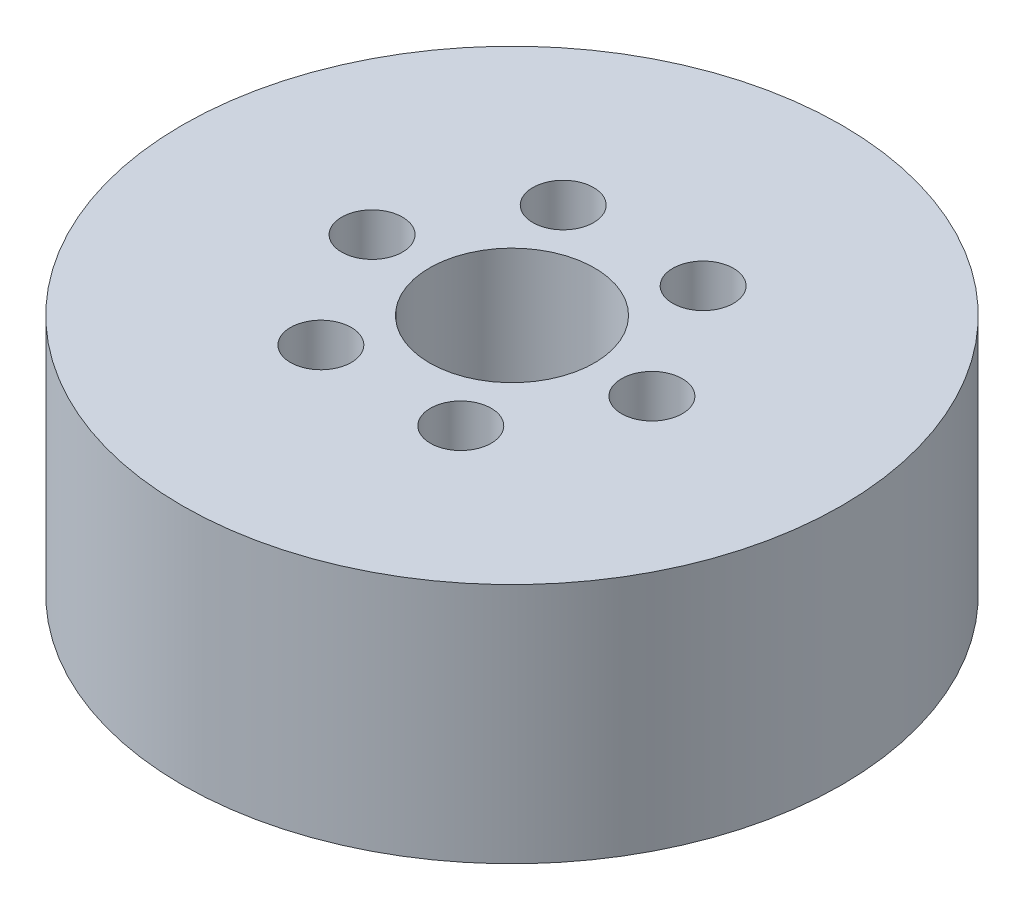
ISO-10303-21;
HEADER;
FILE_DESCRIPTION(('STEP AP214'),'2;1');
FILE_NAME('part.step','',(''),(''),'','','');
FILE_SCHEMA(('AUTOMOTIVE_DESIGN { 1 0 10303 214 1 1 1 1 }'));
ENDSEC;
DATA;
#1=APPLICATION_CONTEXT('core data for automotive mechanical design processes');
#2=APPLICATION_PROTOCOL_DEFINITION('international standard','automotive_design',2000,#1);
#3=PRODUCT_CONTEXT('',#1,'mechanical');
#4=PRODUCT('Part','Part','',(#3));
#5=PRODUCT_RELATED_PRODUCT_CATEGORY('part','',(#4));
#6=PRODUCT_DEFINITION_FORMATION('','',#4);
#7=PRODUCT_DEFINITION_CONTEXT('part definition',#1,'design');
#8=PRODUCT_DEFINITION('design','',#6,#7);
#9=PRODUCT_DEFINITION_SHAPE('','',#8);
#10=(LENGTH_UNIT() NAMED_UNIT(*) SI_UNIT(.MILLI.,.METRE.));
#11=(NAMED_UNIT(*) PLANE_ANGLE_UNIT() SI_UNIT($,.RADIAN.));
#12=(NAMED_UNIT(*) SI_UNIT($,.STERADIAN.) SOLID_ANGLE_UNIT());
#13=UNCERTAINTY_MEASURE_WITH_UNIT(LENGTH_MEASURE(1.E-05),#10,'distance_accuracy_value','');
#14=(GEOMETRIC_REPRESENTATION_CONTEXT(3) GLOBAL_UNCERTAINTY_ASSIGNED_CONTEXT((#13)) GLOBAL_UNIT_ASSIGNED_CONTEXT((#10,
#11,#12)) REPRESENTATION_CONTEXT('',''));
#15=CARTESIAN_POINT('',(0.,0.,0.));
#16=DIRECTION('',(0.,0.,1.));
#17=DIRECTION('',(1.,0.,0.));
#18=AXIS2_PLACEMENT_3D('',#15,#16,#17);
#19=CARTESIAN_POINT('',(0.,22.,0.));
#20=DIRECTION('',(0.,-1.,0.));
#21=DIRECTION('',(0.,0.,-1.));
#22=AXIS2_PLACEMENT_3D('',#19,#20,#21);
#23=CYLINDRICAL_SURFACE('',#22,30.);
#24=CARTESIAN_POINT('',(0.,22.,0.));
#25=DIRECTION('',(0.,1.,0.));
#26=DIRECTION('',(0.,0.,1.));
#27=AXIS2_PLACEMENT_3D('',#24,#25,#26);
#28=CIRCLE('',#27,30.);
#29=CARTESIAN_POINT('',(0.,22.,30.));
#30=VERTEX_POINT('',#29);
#31=EDGE_CURVE('E10',#30,#30,#28,.T.);
#32=ORIENTED_EDGE('',*,*,#31,.F.);
#33=EDGE_LOOP('',(#32));
#34=FACE_BOUND('',#33,.T.);
#35=CARTESIAN_POINT('',(0.,0.,0.));
#36=DIRECTION('',(0.,1.,0.));
#37=DIRECTION('',(0.,0.,1.));
#38=AXIS2_PLACEMENT_3D('',#35,#36,#37);
#39=CIRCLE('',#38,30.);
#40=CARTESIAN_POINT('',(0.,0.,30.));
#41=VERTEX_POINT('',#40);
#42=EDGE_CURVE('E37',#41,#41,#39,.T.);
#43=ORIENTED_EDGE('',*,*,#42,.T.);
#44=EDGE_LOOP('',(#43));
#45=FACE_BOUND('',#44,.T.);
#46=ADVANCED_FACE('F40',(#34,#45),#23,.T.);
#47=CARTESIAN_POINT('',(0.,22.,0.));
#48=DIRECTION('',(0.,1.,0.));
#49=DIRECTION('',(0.,0.,1.));
#50=AXIS2_PLACEMENT_3D('',#47,#48,#49);
#51=PLANE('',#50);
#52=CARTESIAN_POINT('',(-6.36563340943229,22.,-11.0256004874943));
#53=DIRECTION('',(0.,1.,0.));
#54=DIRECTION('',(-0.866025403784433,0.,0.50000000000001));
#55=AXIS2_PLACEMENT_3D('',#52,#53,#54);
#56=CIRCLE('',#55,2.76569619181548);
#57=CARTESIAN_POINT('',(-8.76079657069436,22.,-9.64275239158656));
#58=VERTEX_POINT('',#57);
#59=EDGE_CURVE('E70',#58,#58,#56,.T.);
#60=ORIENTED_EDGE('',*,*,#59,.F.);
#61=EDGE_LOOP('',(#60));
#62=FACE_BOUND('',#61,.T.);
#63=CARTESIAN_POINT('',(6.36563340943206,22.,-11.0256004874945));
#64=DIRECTION('',(0.,1.,0.));
#65=DIRECTION('',(-0.866025403784443,0.,-0.499999999999992));
#66=AXIS2_PLACEMENT_3D('',#63,#64,#65);
#67=CIRCLE('',#66,2.76569619181548);
#68=CARTESIAN_POINT('',(3.97047024816996,22.,-12.4084485834022));
#69=VERTEX_POINT('',#68);
#70=EDGE_CURVE('E71',#69,#69,#67,.T.);
#71=ORIENTED_EDGE('',*,*,#70,.F.);
#72=EDGE_LOOP('',(#71));
#73=FACE_BOUND('',#72,.T.);
#74=CARTESIAN_POINT('',(12.7312668188643,22.,0.));
#75=DIRECTION('',(0.,1.,0.));
#76=DIRECTION('',(0.,0.,-1.));
#77=AXIS2_PLACEMENT_3D('',#74,#75,#76);
#78=CIRCLE('',#77,2.76569619181548);
#79=CARTESIAN_POINT('',(12.7312668188643,22.,-2.76569619181548));
#80=VERTEX_POINT('',#79);
#81=EDGE_CURVE('E78',#80,#80,#78,.T.);
#82=ORIENTED_EDGE('',*,*,#81,.F.);
#83=EDGE_LOOP('',(#82));
#84=FACE_BOUND('',#83,.T.);
#85=CARTESIAN_POINT('',(6.36563340943221,22.,11.0256004874944));
#86=DIRECTION('',(0.,1.,0.));
#87=DIRECTION('',(0.866025403784436,0.,-0.500000000000004));
#88=AXIS2_PLACEMENT_3D('',#85,#86,#87);
#89=CIRCLE('',#88,2.76569619181548);
#90=CARTESIAN_POINT('',(8.76079657069429,22.,9.64275239158662));
#91=VERTEX_POINT('',#90);
#92=EDGE_CURVE('E84',#91,#91,#89,.T.);
#93=ORIENTED_EDGE('',*,*,#92,.F.);
#94=EDGE_LOOP('',(#93));
#95=FACE_BOUND('',#94,.T.);
#96=CARTESIAN_POINT('',(-6.36563340943214,22.,11.0256004874944));
#97=DIRECTION('',(0.,1.,0.));
#98=DIRECTION('',(0.86602540378444,0.,0.499999999999998));
#99=AXIS2_PLACEMENT_3D('',#96,#97,#98);
#100=CIRCLE('',#99,2.76569619181548);
#101=CARTESIAN_POINT('',(-3.97047024817005,22.,12.4084485834022));
#102=VERTEX_POINT('',#101);
#103=EDGE_CURVE('E61',#102,#102,#100,.T.);
#104=ORIENTED_EDGE('',*,*,#103,.F.);
#105=EDGE_LOOP('',(#104));
#106=FACE_BOUND('',#105,.T.);
#107=CARTESIAN_POINT('',(-12.7312668188643,22.,0.));
#108=DIRECTION('',(0.,1.,0.));
#109=DIRECTION('',(0.,0.,1.));
#110=AXIS2_PLACEMENT_3D('',#107,#108,#109);
#111=CIRCLE('',#110,2.76569619181548);
#112=CARTESIAN_POINT('',(-12.7312668188643,22.,2.76569619181548));
#113=VERTEX_POINT('',#112);
#114=EDGE_CURVE('E54',#113,#113,#111,.T.);
#115=ORIENTED_EDGE('',*,*,#114,.F.);
#116=EDGE_LOOP('',(#115));
#117=FACE_BOUND('',#116,.T.);
#118=CARTESIAN_POINT('',(0.,22.,0.));
#119=DIRECTION('',(0.,1.,0.));
#120=DIRECTION('',(0.,0.,1.));
#121=AXIS2_PLACEMENT_3D('',#118,#119,#120);
#122=CIRCLE('',#121,7.5);
#123=CARTESIAN_POINT('',(0.,22.,7.5));
#124=VERTEX_POINT('',#123);
#125=EDGE_CURVE('E50',#124,#124,#122,.T.);
#126=ORIENTED_EDGE('',*,*,#125,.F.);
#127=EDGE_LOOP('',(#126));
#128=FACE_BOUND('',#127,.T.);
#129=ORIENTED_EDGE('',*,*,#31,.T.);
#130=EDGE_LOOP('',(#129));
#131=FACE_BOUND('',#130,.T.);
#132=ADVANCED_FACE('F99',(#62,#73,#84,#95,#106,#117,#128,#131),#51,.T.);
#133=CARTESIAN_POINT('',(0.,0.,0.));
#134=DIRECTION('',(0.,1.,0.));
#135=DIRECTION('',(0.,0.,1.));
#136=AXIS2_PLACEMENT_3D('',#133,#134,#135);
#137=PLANE('',#136);
#138=CARTESIAN_POINT('',(0.,0.,0.));
#139=DIRECTION('',(0.,1.,0.));
#140=DIRECTION('',(0.,0.,1.));
#141=AXIS2_PLACEMENT_3D('',#138,#139,#140);
#142=CIRCLE('',#141,7.5);
#143=CARTESIAN_POINT('',(0.,0.,7.5));
#144=VERTEX_POINT('',#143);
#145=EDGE_CURVE('E47',#144,#144,#142,.T.);
#146=ORIENTED_EDGE('',*,*,#145,.T.);
#147=EDGE_LOOP('',(#146));
#148=FACE_BOUND('',#147,.T.);
#149=ORIENTED_EDGE('',*,*,#42,.F.);
#150=EDGE_LOOP('',(#149));
#151=FACE_BOUND('',#150,.T.);
#152=ADVANCED_FACE('F103',(#148,#151),#137,.F.);
#153=CARTESIAN_POINT('',(0.,22.,0.));
#154=DIRECTION('',(0.,-1.,0.));
#155=DIRECTION('',(0.,0.,-1.));
#156=AXIS2_PLACEMENT_3D('',#153,#154,#155);
#157=CYLINDRICAL_SURFACE('',#156,7.5);
#158=ORIENTED_EDGE('',*,*,#125,.T.);
#159=EDGE_LOOP('',(#158));
#160=FACE_BOUND('',#159,.T.);
#161=ORIENTED_EDGE('',*,*,#145,.F.);
#162=EDGE_LOOP('',(#161));
#163=FACE_BOUND('',#162,.T.);
#164=ADVANCED_FACE('F115',(#160,#163),#157,.F.);
#165=CARTESIAN_POINT('',(-12.7312668188643,0.216205112235187,0.));
#166=DIRECTION('',(0.,1.,0.));
#167=DIRECTION('',(0.,0.,1.));
#168=AXIS2_PLACEMENT_3D('',#165,#166,#167);
#169=CYLINDRICAL_SURFACE('',#168,2.76569619181548);
#170=CARTESIAN_POINT('',(-12.7312668188643,0.216205112235187,0.));
#171=DIRECTION('',(0.,1.,0.));
#172=DIRECTION('',(0.,0.,1.));
#173=AXIS2_PLACEMENT_3D('',#170,#171,#172);
#174=CIRCLE('',#173,2.76569619181548);
#175=CARTESIAN_POINT('',(-12.7312668188643,0.216205112235187,2.76569619181548));
#176=VERTEX_POINT('',#175);
#177=EDGE_CURVE('E55',#176,#176,#174,.T.);
#178=ORIENTED_EDGE('',*,*,#177,.F.);
#179=EDGE_LOOP('',(#178));
#180=FACE_BOUND('',#179,.T.);
#181=ORIENTED_EDGE('',*,*,#114,.T.);
#182=EDGE_LOOP('',(#181));
#183=FACE_BOUND('',#182,.T.);
#184=ADVANCED_FACE('F113',(#180,#183),#169,.F.);
#185=CARTESIAN_POINT('',(-12.7312668188643,0.216205112235187,0.));
#186=DIRECTION('',(0.,1.,0.));
#187=DIRECTION('',(0.,0.,1.));
#188=AXIS2_PLACEMENT_3D('',#185,#186,#187);
#189=PLANE('',#188);
#190=ORIENTED_EDGE('',*,*,#177,.T.);
#191=EDGE_LOOP('',(#190));
#192=FACE_BOUND('',#191,.T.);
#193=ADVANCED_FACE('F144',(#192),#189,.T.);
#194=CARTESIAN_POINT('',(-6.36563340943214,0.216205112235187,11.0256004874944));
#195=DIRECTION('',(0.,1.,0.));
#196=DIRECTION('',(0.,0.,1.));
#197=AXIS2_PLACEMENT_3D('',#194,#195,#196);
#198=CYLINDRICAL_SURFACE('',#197,2.76569619181548);
#199=CARTESIAN_POINT('',(-6.36563340943214,0.216205112235187,11.0256004874944));
#200=DIRECTION('',(0.,1.,0.));
#201=DIRECTION('',(0.86602540378444,0.,0.499999999999998));
#202=AXIS2_PLACEMENT_3D('',#199,#200,#201);
#203=CIRCLE('',#202,2.76569619181548);
#204=CARTESIAN_POINT('',(-3.97047024817005,0.216205112235187,12.4084485834022));
#205=VERTEX_POINT('',#204);
#206=EDGE_CURVE('E59',#205,#205,#203,.T.);
#207=ORIENTED_EDGE('',*,*,#206,.F.);
#208=EDGE_LOOP('',(#207));
#209=FACE_BOUND('',#208,.T.);
#210=ORIENTED_EDGE('',*,*,#103,.T.);
#211=EDGE_LOOP('',(#210));
#212=FACE_BOUND('',#211,.T.);
#213=ADVANCED_FACE('F153',(#209,#212),#198,.F.);
#214=CARTESIAN_POINT('',(-6.36563340943214,0.216205112235187,11.0256004874944));
#215=DIRECTION('',(0.,1.,0.));
#216=DIRECTION('',(0.86602540378444,0.,0.499999999999998));
#217=AXIS2_PLACEMENT_3D('',#214,#215,#216);
#218=PLANE('',#217);
#219=ORIENTED_EDGE('',*,*,#206,.T.);
#220=EDGE_LOOP('',(#219));
#221=FACE_BOUND('',#220,.T.);
#222=ADVANCED_FACE('F96',(#221),#218,.T.);
#223=CARTESIAN_POINT('',(6.36563340943221,0.216205112235187,11.0256004874944));
#224=DIRECTION('',(0.,1.,0.));
#225=DIRECTION('',(0.,0.,1.));
#226=AXIS2_PLACEMENT_3D('',#223,#224,#225);
#227=CYLINDRICAL_SURFACE('',#226,2.76569619181548);
#228=CARTESIAN_POINT('',(6.36563340943221,0.216205112235187,11.0256004874944));
#229=DIRECTION('',(0.,1.,0.));
#230=DIRECTION('',(0.866025403784436,0.,-0.500000000000004));
#231=AXIS2_PLACEMENT_3D('',#228,#229,#230);
#232=CIRCLE('',#231,2.76569619181548);
#233=CARTESIAN_POINT('',(8.76079657069429,0.216205112235187,9.64275239158662));
#234=VERTEX_POINT('',#233);
#235=EDGE_CURVE('E63',#234,#234,#232,.T.);
#236=ORIENTED_EDGE('',*,*,#235,.F.);
#237=EDGE_LOOP('',(#236));
#238=FACE_BOUND('',#237,.T.);
#239=ORIENTED_EDGE('',*,*,#92,.T.);
#240=EDGE_LOOP('',(#239));
#241=FACE_BOUND('',#240,.T.);
#242=ADVANCED_FACE('F91',(#238,#241),#227,.F.);
#243=CARTESIAN_POINT('',(6.36563340943221,0.216205112235187,11.0256004874944));
#244=DIRECTION('',(0.,1.,0.));
#245=DIRECTION('',(0.866025403784436,0.,-0.500000000000004));
#246=AXIS2_PLACEMENT_3D('',#243,#244,#245);
#247=PLANE('',#246);
#248=ORIENTED_EDGE('',*,*,#235,.T.);
#249=EDGE_LOOP('',(#248));
#250=FACE_BOUND('',#249,.T.);
#251=ADVANCED_FACE('F93',(#250),#247,.T.);
#252=CARTESIAN_POINT('',(12.7312668188643,0.216205112235187,0.));
#253=DIRECTION('',(0.,1.,0.));
#254=DIRECTION('',(0.,0.,1.));
#255=AXIS2_PLACEMENT_3D('',#252,#253,#254);
#256=CYLINDRICAL_SURFACE('',#255,2.76569619181548);
#257=CARTESIAN_POINT('',(12.7312668188643,0.216205112235187,0.));
#258=DIRECTION('',(0.,1.,0.));
#259=DIRECTION('',(0.,0.,-1.));
#260=AXIS2_PLACEMENT_3D('',#257,#258,#259);
#261=CIRCLE('',#260,2.76569619181548);
#262=CARTESIAN_POINT('',(12.7312668188643,0.216205112235187,-2.76569619181548));
#263=VERTEX_POINT('',#262);
#264=EDGE_CURVE('E85',#263,#263,#261,.T.);
#265=ORIENTED_EDGE('',*,*,#264,.F.);
#266=EDGE_LOOP('',(#265));
#267=FACE_BOUND('',#266,.T.);
#268=ORIENTED_EDGE('',*,*,#81,.T.);
#269=EDGE_LOOP('',(#268));
#270=FACE_BOUND('',#269,.T.);
#271=ADVANCED_FACE('F187',(#267,#270),#256,.F.);
#272=CARTESIAN_POINT('',(12.7312668188643,0.216205112235187,0.));
#273=DIRECTION('',(0.,1.,0.));
#274=DIRECTION('',(0.,0.,-1.));
#275=AXIS2_PLACEMENT_3D('',#272,#273,#274);
#276=PLANE('',#275);
#277=ORIENTED_EDGE('',*,*,#264,.T.);
#278=EDGE_LOOP('',(#277));
#279=FACE_BOUND('',#278,.T.);
#280=ADVANCED_FACE('F198',(#279),#276,.T.);
#281=CARTESIAN_POINT('',(6.36563340943206,0.216205112235187,-11.0256004874945));
#282=DIRECTION('',(0.,1.,0.));
#283=DIRECTION('',(0.,0.,1.));
#284=AXIS2_PLACEMENT_3D('',#281,#282,#283);
#285=CYLINDRICAL_SURFACE('',#284,2.76569619181548);
#286=CARTESIAN_POINT('',(6.36563340943206,0.216205112235187,-11.0256004874945));
#287=DIRECTION('',(0.,1.,0.));
#288=DIRECTION('',(-0.866025403784443,0.,-0.499999999999992));
#289=AXIS2_PLACEMENT_3D('',#286,#287,#288);
#290=CIRCLE('',#289,2.76569619181548);
#291=CARTESIAN_POINT('',(3.97047024816996,0.216205112235187,-12.4084485834022));
#292=VERTEX_POINT('',#291);
#293=EDGE_CURVE('E76',#292,#292,#290,.T.);
#294=ORIENTED_EDGE('',*,*,#293,.F.);
#295=EDGE_LOOP('',(#294));
#296=FACE_BOUND('',#295,.T.);
#297=ORIENTED_EDGE('',*,*,#70,.T.);
#298=EDGE_LOOP('',(#297));
#299=FACE_BOUND('',#298,.T.);
#300=ADVANCED_FACE('F202',(#296,#299),#285,.F.);
#301=CARTESIAN_POINT('',(6.36563340943206,0.216205112235187,-11.0256004874945));
#302=DIRECTION('',(0.,1.,0.));
#303=DIRECTION('',(-0.866025403784443,0.,-0.499999999999992));
#304=AXIS2_PLACEMENT_3D('',#301,#302,#303);
#305=PLANE('',#304);
#306=ORIENTED_EDGE('',*,*,#293,.T.);
#307=EDGE_LOOP('',(#306));
#308=FACE_BOUND('',#307,.T.);
#309=ADVANCED_FACE('F212',(#308),#305,.T.);
#310=CARTESIAN_POINT('',(-6.36563340943229,0.216205112235187,-11.0256004874943));
#311=DIRECTION('',(0.,1.,0.));
#312=DIRECTION('',(0.,0.,1.));
#313=AXIS2_PLACEMENT_3D('',#310,#311,#312);
#314=CYLINDRICAL_SURFACE('',#313,2.76569619181548);
#315=CARTESIAN_POINT('',(-6.36563340943229,0.216205112235187,-11.0256004874943));
#316=DIRECTION('',(0.,1.,0.));
#317=DIRECTION('',(-0.866025403784433,0.,0.50000000000001));
#318=AXIS2_PLACEMENT_3D('',#315,#316,#317);
#319=CIRCLE('',#318,2.76569619181548);
#320=CARTESIAN_POINT('',(-8.76079657069436,0.216205112235187,-9.64275239158656));
#321=VERTEX_POINT('',#320);
#322=EDGE_CURVE('E69',#321,#321,#319,.T.);
#323=ORIENTED_EDGE('',*,*,#322,.F.);
#324=EDGE_LOOP('',(#323));
#325=FACE_BOUND('',#324,.T.);
#326=ORIENTED_EDGE('',*,*,#59,.T.);
#327=EDGE_LOOP('',(#326));
#328=FACE_BOUND('',#327,.T.);
#329=ADVANCED_FACE('F224',(#325,#328),#314,.F.);
#330=CARTESIAN_POINT('',(-6.36563340943229,0.216205112235187,-11.0256004874943));
#331=DIRECTION('',(0.,1.,0.));
#332=DIRECTION('',(-0.866025403784433,0.,0.50000000000001));
#333=AXIS2_PLACEMENT_3D('',#330,#331,#332);
#334=PLANE('',#333);
#335=ORIENTED_EDGE('',*,*,#322,.T.);
#336=EDGE_LOOP('',(#335));
#337=FACE_BOUND('',#336,.T.);
#338=ADVANCED_FACE('F235',(#337),#334,.T.);
#339=CLOSED_SHELL('',(#46,#132,#152,#164,#184,#193,#213,#222,#242,#251,#271,#280,#300,#309,#329,#338));
#340=MANIFOLD_SOLID_BREP('B2',#339);
#341=ADVANCED_BREP_SHAPE_REPRESENTATION('',(#18,#340),#14);
#342=SHAPE_DEFINITION_REPRESENTATION(#9,#341);
ENDSEC;
END-ISO-10303-21;
